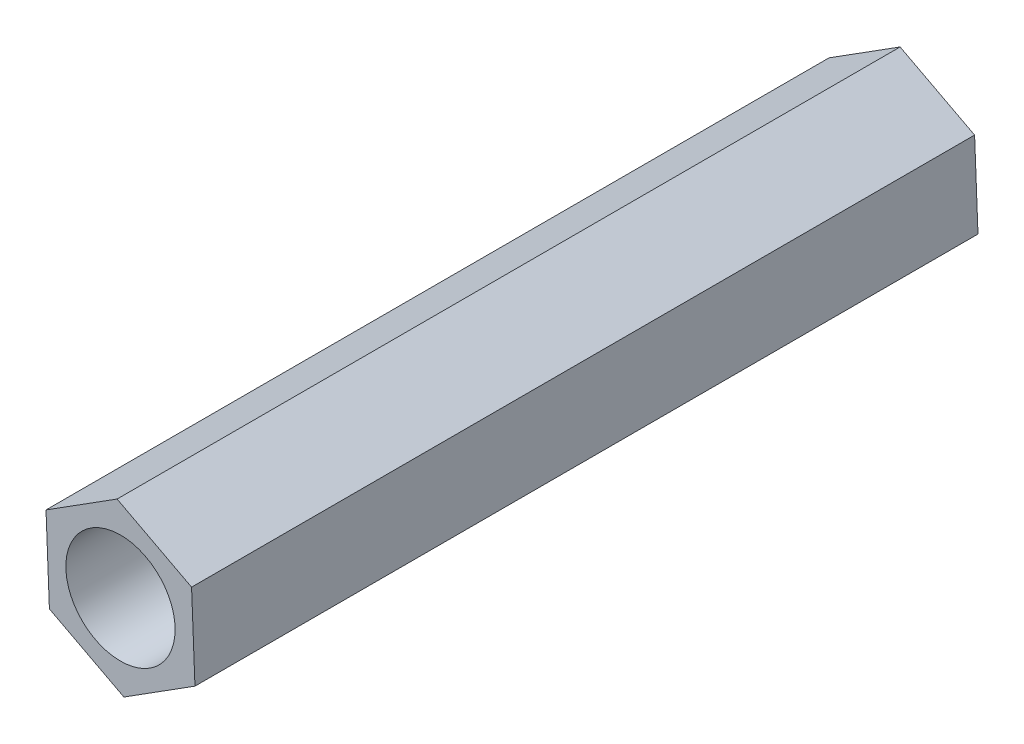
ISO-10303-21;
HEADER;
FILE_DESCRIPTION(('STEP AP214'),'2;1');
FILE_NAME('part.step','',(''),(''),'','','');
FILE_SCHEMA(('AUTOMOTIVE_DESIGN { 1 0 10303 214 1 1 1 1 }'));
ENDSEC;
DATA;
#1=APPLICATION_CONTEXT('core data for automotive mechanical design processes');
#2=APPLICATION_PROTOCOL_DEFINITION('international standard','automotive_design',2000,#1);
#3=PRODUCT_CONTEXT('',#1,'mechanical');
#4=PRODUCT('Part','Part','',(#3));
#5=PRODUCT_RELATED_PRODUCT_CATEGORY('part','',(#4));
#6=PRODUCT_DEFINITION_FORMATION('','',#4);
#7=PRODUCT_DEFINITION_CONTEXT('part definition',#1,'design');
#8=PRODUCT_DEFINITION('design','',#6,#7);
#9=PRODUCT_DEFINITION_SHAPE('','',#8);
#10=(LENGTH_UNIT() NAMED_UNIT(*) SI_UNIT(.MILLI.,.METRE.));
#11=(NAMED_UNIT(*) PLANE_ANGLE_UNIT() SI_UNIT($,.RADIAN.));
#12=(NAMED_UNIT(*) SI_UNIT($,.STERADIAN.) SOLID_ANGLE_UNIT());
#13=UNCERTAINTY_MEASURE_WITH_UNIT(LENGTH_MEASURE(1.E-05),#10,'distance_accuracy_value','');
#14=(GEOMETRIC_REPRESENTATION_CONTEXT(3) GLOBAL_UNCERTAINTY_ASSIGNED_CONTEXT((#13)) GLOBAL_UNIT_ASSIGNED_CONTEXT((#10,
#11,#12)) REPRESENTATION_CONTEXT('',''));
#15=CARTESIAN_POINT('',(0.,0.,0.));
#16=DIRECTION('',(0.,0.,1.));
#17=DIRECTION('',(1.,0.,0.));
#18=AXIS2_PLACEMENT_3D('',#15,#16,#17);
#19=CARTESIAN_POINT('',(0.187134398577121,-4.61500964789918,-43.));
#20=DIRECTION('',(-0.534677148957081,0.845056416094884,0.));
#21=DIRECTION('',(-0.845056416094884,-0.534677148957081,0.));
#22=AXIS2_PLACEMENT_3D('',#19,#20,#21);
#23=PLANE('',#22);
#24=DIRECTION('',(0.845056416094884,0.534677148957081,0.));
#25=VECTOR('',#24,1.);
#26=CARTESIAN_POINT('',(0.187134398577121,-4.61500964789918,0.));
#27=LINE('',#26,#25);
#28=CARTESIAN_POINT('',(0.187134398577121,-4.61500964789918,0.));
#29=VERTEX_POINT('',#28);
#30=CARTESIAN_POINT('',(4.09028279307952,-2.14544168085984,0.));
#31=VERTEX_POINT('',#30);
#32=EDGE_CURVE('E116',#29,#31,#27,.T.);
#33=ORIENTED_EDGE('',*,*,#32,.F.);
#34=DIRECTION('',(0.,0.,0.999999999999999));
#35=VECTOR('',#34,1.);
#36=CARTESIAN_POINT('',(0.187134398577121,-4.61500964789918,-43.));
#37=LINE('',#36,#35);
#38=CARTESIAN_POINT('',(0.187134398577121,-4.61500964789918,-43.));
#39=VERTEX_POINT('',#38);
#40=EDGE_CURVE('E115',#39,#29,#37,.T.);
#41=ORIENTED_EDGE('',*,*,#40,.F.);
#42=DIRECTION('',(0.845056416094884,0.534677148957081,0.));
#43=VECTOR('',#42,1.);
#44=CARTESIAN_POINT('',(0.187134398577121,-4.61500964789918,-43.));
#45=LINE('',#44,#43);
#46=CARTESIAN_POINT('',(4.09028279307952,-2.14544168085984,-43.));
#47=VERTEX_POINT('',#46);
#48=EDGE_CURVE('E129',#39,#47,#45,.T.);
#49=ORIENTED_EDGE('',*,*,#48,.T.);
#50=DIRECTION('',(0.,0.,0.999999999999999));
#51=VECTOR('',#50,1.);
#52=CARTESIAN_POINT('',(4.09028279307952,-2.14544168085984,-43.));
#53=LINE('',#52,#51);
#54=EDGE_CURVE('E11',#47,#31,#53,.T.);
#55=ORIENTED_EDGE('',*,*,#54,.T.);
#56=EDGE_LOOP('',(#33,#41,#49,#55));
#57=FACE_BOUND('',#56,.T.);
#58=ADVANCED_FACE('F33',(#57),#23,.F.);
#59=CARTESIAN_POINT('',(4.09028279307952,-2.14544168085984,-43.));
#60=DIRECTION('',(-0.999178898447743,-0.0405157857724263,0.));
#61=DIRECTION('',(0.0405157857724263,-0.999178898447743,0.));
#62=AXIS2_PLACEMENT_3D('',#59,#60,#61);
#63=PLANE('',#62);
#64=DIRECTION('',(-0.0405157857724263,0.999178898447742,0.));
#65=VECTOR('',#64,1.);
#66=CARTESIAN_POINT('',(4.09028279307952,-2.14544168085984,0.));
#67=LINE('',#66,#65);
#68=CARTESIAN_POINT('',(3.9031483945024,2.46956796703932,0.));
#69=VERTEX_POINT('',#68);
#70=EDGE_CURVE('E118',#31,#69,#67,.T.);
#71=ORIENTED_EDGE('',*,*,#70,.F.);
#72=ORIENTED_EDGE('',*,*,#54,.F.);
#73=DIRECTION('',(-0.0405157857724263,0.999178898447742,0.));
#74=VECTOR('',#73,1.);
#75=CARTESIAN_POINT('',(4.09028279307952,-2.14544168085984,-43.));
#76=LINE('',#75,#74);
#77=CARTESIAN_POINT('',(3.9031483945024,2.46956796703932,-43.));
#78=VERTEX_POINT('',#77);
#79=EDGE_CURVE('E81',#47,#78,#76,.T.);
#80=ORIENTED_EDGE('',*,*,#79,.T.);
#81=DIRECTION('',(0.,0.,0.999999999999999));
#82=VECTOR('',#81,1.);
#83=CARTESIAN_POINT('',(3.9031483945024,2.46956796703932,-43.));
#84=LINE('',#83,#82);
#85=EDGE_CURVE('E41',#78,#69,#84,.T.);
#86=ORIENTED_EDGE('',*,*,#85,.T.);
#87=EDGE_LOOP('',(#71,#72,#80,#86));
#88=FACE_BOUND('',#87,.T.);
#89=ADVANCED_FACE('F135',(#88),#63,.F.);
#90=CARTESIAN_POINT('',(3.9031483945024,2.46956796703932,-43.));
#91=DIRECTION('',(-0.464501749490663,-0.88557220186731,0.));
#92=DIRECTION('',(0.88557220186731,-0.464501749490663,0.));
#93=AXIS2_PLACEMENT_3D('',#90,#91,#92);
#94=PLANE('',#93);
#95=DIRECTION('',(-0.885572201867309,0.464501749490663,0.));
#96=VECTOR('',#95,1.);
#97=CARTESIAN_POINT('',(3.9031483945024,2.46956796703932,0.));
#98=LINE('',#97,#96);
#99=CARTESIAN_POINT('',(-0.187134398577107,4.61500964789924,0.));
#100=VERTEX_POINT('',#99);
#101=EDGE_CURVE('E122',#69,#100,#98,.T.);
#102=ORIENTED_EDGE('',*,*,#101,.F.);
#103=ORIENTED_EDGE('',*,*,#85,.F.);
#104=DIRECTION('',(-0.885572201867309,0.464501749490663,0.));
#105=VECTOR('',#104,1.);
#106=CARTESIAN_POINT('',(3.9031483945024,2.46956796703932,-43.));
#107=LINE('',#106,#105);
#108=CARTESIAN_POINT('',(-0.187134398577107,4.61500964789924,-43.));
#109=VERTEX_POINT('',#108);
#110=EDGE_CURVE('E109',#78,#109,#107,.T.);
#111=ORIENTED_EDGE('',*,*,#110,.T.);
#112=DIRECTION('',(0.,0.,0.999999999999999));
#113=VECTOR('',#112,1.);
#114=CARTESIAN_POINT('',(-0.187134398577107,4.61500964789924,-43.));
#115=LINE('',#114,#113);
#116=EDGE_CURVE('E103',#109,#100,#115,.T.);
#117=ORIENTED_EDGE('',*,*,#116,.T.);
#118=EDGE_LOOP('',(#102,#103,#111,#117));
#119=FACE_BOUND('',#118,.T.);
#120=ADVANCED_FACE('F169',(#119),#94,.F.);
#121=CARTESIAN_POINT('',(-0.187134398577107,4.61500964789924,-43.));
#122=DIRECTION('',(0.534677148957081,-0.845056416094884,0.));
#123=DIRECTION('',(0.845056416094884,0.534677148957081,0.));
#124=AXIS2_PLACEMENT_3D('',#121,#122,#123);
#125=PLANE('',#124);
#126=DIRECTION('',(-0.845056416094884,-0.534677148957081,0.));
#127=VECTOR('',#126,1.);
#128=CARTESIAN_POINT('',(-0.187134398577107,4.61500964789924,0.));
#129=LINE('',#128,#127);
#130=CARTESIAN_POINT('',(-4.0902827930796,2.14544168085995,0.));
#131=VERTEX_POINT('',#130);
#132=EDGE_CURVE('E125',#100,#131,#129,.T.);
#133=ORIENTED_EDGE('',*,*,#132,.F.);
#134=ORIENTED_EDGE('',*,*,#116,.F.);
#135=DIRECTION('',(-0.845056416094884,-0.534677148957081,0.));
#136=VECTOR('',#135,1.);
#137=CARTESIAN_POINT('',(-0.187134398577107,4.61500964789924,-43.));
#138=LINE('',#137,#136);
#139=CARTESIAN_POINT('',(-4.0902827930796,2.14544168085995,-43.));
#140=VERTEX_POINT('',#139);
#141=EDGE_CURVE('E93',#109,#140,#138,.T.);
#142=ORIENTED_EDGE('',*,*,#141,.T.);
#143=DIRECTION('',(0.,0.,0.999999999999999));
#144=VECTOR('',#143,1.);
#145=CARTESIAN_POINT('',(-4.0902827930796,2.14544168085995,-43.));
#146=LINE('',#145,#144);
#147=EDGE_CURVE('E98',#140,#131,#146,.T.);
#148=ORIENTED_EDGE('',*,*,#147,.T.);
#149=EDGE_LOOP('',(#133,#134,#142,#148));
#150=FACE_BOUND('',#149,.T.);
#151=ADVANCED_FACE('F106',(#150),#125,.F.);
#152=CARTESIAN_POINT('',(-4.0902827930796,2.14544168085995,-43.));
#153=DIRECTION('',(0.999178898447743,0.0405157857724258,0.));
#154=DIRECTION('',(-0.0405157857724258,0.999178898447743,0.));
#155=AXIS2_PLACEMENT_3D('',#152,#153,#154);
#156=PLANE('',#155);
#157=DIRECTION('',(0.0405157857724259,-0.999178898447742,0.));
#158=VECTOR('',#157,1.);
#159=CARTESIAN_POINT('',(-4.0902827930796,2.14544168085995,0.));
#160=LINE('',#159,#158);
#161=CARTESIAN_POINT('',(-3.90314839450248,-2.46956796703929,0.));
#162=VERTEX_POINT('',#161);
#163=EDGE_CURVE('E100',#131,#162,#160,.T.);
#164=ORIENTED_EDGE('',*,*,#163,.F.);
#165=ORIENTED_EDGE('',*,*,#147,.F.);
#166=DIRECTION('',(0.0405157857724259,-0.999178898447742,0.));
#167=VECTOR('',#166,1.);
#168=CARTESIAN_POINT('',(-4.0902827930796,2.14544168085995,-43.));
#169=LINE('',#168,#167);
#170=CARTESIAN_POINT('',(-3.90314839450248,-2.46956796703929,-43.));
#171=VERTEX_POINT('',#170);
#172=EDGE_CURVE('E89',#140,#171,#169,.T.);
#173=ORIENTED_EDGE('',*,*,#172,.T.);
#174=DIRECTION('',(0.,0.,0.999999999999999));
#175=VECTOR('',#174,1.);
#176=CARTESIAN_POINT('',(-3.90314839450248,-2.46956796703929,-43.));
#177=LINE('',#176,#175);
#178=EDGE_CURVE('E104',#171,#162,#177,.T.);
#179=ORIENTED_EDGE('',*,*,#178,.T.);
#180=EDGE_LOOP('',(#164,#165,#173,#179));
#181=FACE_BOUND('',#180,.T.);
#182=ADVANCED_FACE('F99',(#181),#156,.F.);
#183=CARTESIAN_POINT('',(-3.90314839450248,-2.46956796703929,-43.));
#184=DIRECTION('',(0.464501749490663,0.88557220186731,0.));
#185=DIRECTION('',(-0.88557220186731,0.464501749490663,0.));
#186=AXIS2_PLACEMENT_3D('',#183,#184,#185);
#187=PLANE('',#186);
#188=DIRECTION('',(0.88557220186731,-0.464501749490663,0.));
#189=VECTOR('',#188,1.);
#190=CARTESIAN_POINT('',(-3.90314839450248,-2.46956796703929,0.));
#191=LINE('',#190,#189);
#192=EDGE_CURVE('E69',#162,#29,#191,.T.);
#193=ORIENTED_EDGE('',*,*,#192,.F.);
#194=ORIENTED_EDGE('',*,*,#178,.F.);
#195=DIRECTION('',(0.88557220186731,-0.464501749490663,0.));
#196=VECTOR('',#195,1.);
#197=CARTESIAN_POINT('',(-3.90314839450248,-2.46956796703929,-43.));
#198=LINE('',#197,#196);
#199=EDGE_CURVE('E49',#171,#39,#198,.T.);
#200=ORIENTED_EDGE('',*,*,#199,.T.);
#201=ORIENTED_EDGE('',*,*,#40,.T.);
#202=EDGE_LOOP('',(#193,#194,#200,#201));
#203=FACE_BOUND('',#202,.T.);
#204=ADVANCED_FACE('F162',(#203),#187,.F.);
#205=CARTESIAN_POINT('',(0.,0.,-43.));
#206=DIRECTION('',(0.,0.,-0.999999999999999));
#207=DIRECTION('',(1.,0.,0.));
#208=AXIS2_PLACEMENT_3D('',#205,#206,#207);
#209=PLANE('',#208);
#210=CARTESIAN_POINT('',(0.,0.,-43.));
#211=DIRECTION('',(0.,0.,0.999999999999999));
#212=DIRECTION('',(1.,0.,0.));
#213=AXIS2_PLACEMENT_3D('',#210,#211,#212);
#214=CIRCLE('',#213,3.);
#215=CARTESIAN_POINT('',(3.,0.,-43.));
#216=VERTEX_POINT('',#215);
#217=EDGE_CURVE('E146',#216,#216,#214,.T.);
#218=ORIENTED_EDGE('',*,*,#217,.T.);
#219=EDGE_LOOP('',(#218));
#220=FACE_BOUND('',#219,.T.);
#221=ORIENTED_EDGE('',*,*,#48,.F.);
#222=ORIENTED_EDGE('',*,*,#199,.F.);
#223=ORIENTED_EDGE('',*,*,#172,.F.);
#224=ORIENTED_EDGE('',*,*,#141,.F.);
#225=ORIENTED_EDGE('',*,*,#110,.F.);
#226=ORIENTED_EDGE('',*,*,#79,.F.);
#227=EDGE_LOOP('',(#221,#222,#223,#224,#225,#226));
#228=FACE_BOUND('',#227,.T.);
#229=ADVANCED_FACE('F91',(#220,#228),#209,.T.);
#230=CARTESIAN_POINT('',(0.,0.,0.));
#231=DIRECTION('',(0.,0.,-0.999999999999999));
#232=DIRECTION('',(1.,0.,0.));
#233=AXIS2_PLACEMENT_3D('',#230,#231,#232);
#234=PLANE('',#233);
#235=CARTESIAN_POINT('',(0.,0.,0.));
#236=DIRECTION('',(0.,0.,0.999999999999999));
#237=DIRECTION('',(1.,0.,0.));
#238=AXIS2_PLACEMENT_3D('',#235,#236,#237);
#239=CIRCLE('',#238,3.);
#240=CARTESIAN_POINT('',(3.,0.,0.));
#241=VERTEX_POINT('',#240);
#242=EDGE_CURVE('E119',#241,#241,#239,.F.);
#243=ORIENTED_EDGE('',*,*,#242,.T.);
#244=EDGE_LOOP('',(#243));
#245=FACE_BOUND('',#244,.T.);
#246=ORIENTED_EDGE('',*,*,#32,.T.);
#247=ORIENTED_EDGE('',*,*,#70,.T.);
#248=ORIENTED_EDGE('',*,*,#101,.T.);
#249=ORIENTED_EDGE('',*,*,#132,.T.);
#250=ORIENTED_EDGE('',*,*,#163,.T.);
#251=ORIENTED_EDGE('',*,*,#192,.T.);
#252=EDGE_LOOP('',(#246,#247,#248,#249,#250,#251));
#253=FACE_BOUND('',#252,.T.);
#254=ADVANCED_FACE('F137',(#245,#253),#234,.F.);
#255=CARTESIAN_POINT('',(0.,0.,0.000999999999973245));
#256=DIRECTION('',(0.,0.,-0.999999999999999));
#257=DIRECTION('',(1.,0.,0.));
#258=AXIS2_PLACEMENT_3D('',#255,#256,#257);
#259=CYLINDRICAL_SURFACE('',#258,3.);
#260=CARTESIAN_POINT('',(3.,0.,-43.));
#261=CARTESIAN_POINT('',(3.,0.,-42.5520833333333));
#262=CARTESIAN_POINT('',(3.,0.,-42.1041666666666));
#263=CARTESIAN_POINT('',(3.,0.,-41.2083333333333));
#264=CARTESIAN_POINT('',(3.,0.,-40.7604166666666));
#265=CARTESIAN_POINT('',(3.,0.,-39.8645833333333));
#266=CARTESIAN_POINT('',(3.,0.,-39.4166666666667));
#267=CARTESIAN_POINT('',(3.,0.,-38.5208333333333));
#268=CARTESIAN_POINT('',(3.,0.,-38.0729166666667));
#269=CARTESIAN_POINT('',(3.,0.,-37.1770833333333));
#270=CARTESIAN_POINT('',(3.,0.,-36.7291666666666));
#271=CARTESIAN_POINT('',(3.,0.,-35.8333333333333));
#272=CARTESIAN_POINT('',(3.,0.,-35.3854166666667));
#273=CARTESIAN_POINT('',(3.,0.,-34.4895833333333));
#274=CARTESIAN_POINT('',(3.,0.,-34.0416666666667));
#275=CARTESIAN_POINT('',(3.,0.,-33.1458333333333));
#276=CARTESIAN_POINT('',(3.,0.,-32.6979166666667));
#277=CARTESIAN_POINT('',(3.,0.,-31.8020833333333));
#278=CARTESIAN_POINT('',(3.,0.,-31.3541666666667));
#279=CARTESIAN_POINT('',(3.,0.,-30.4583333333333));
#280=CARTESIAN_POINT('',(3.,0.,-30.0104166666667));
#281=CARTESIAN_POINT('',(3.,0.,-29.1145833333333));
#282=CARTESIAN_POINT('',(3.,0.,-28.6666666666667));
#283=CARTESIAN_POINT('',(3.,0.,-27.7708333333333));
#284=CARTESIAN_POINT('',(3.,0.,-27.3229166666667));
#285=CARTESIAN_POINT('',(3.,0.,-26.4270833333333));
#286=CARTESIAN_POINT('',(3.,0.,-25.9791666666667));
#287=CARTESIAN_POINT('',(3.,0.,-25.0833333333333));
#288=CARTESIAN_POINT('',(3.,0.,-24.6354166666667));
#289=CARTESIAN_POINT('',(3.,0.,-23.7395833333333));
#290=CARTESIAN_POINT('',(3.,0.,-23.2916666666667));
#291=CARTESIAN_POINT('',(3.,0.,-22.3958333333333));
#292=CARTESIAN_POINT('',(3.,0.,-21.9479166666667));
#293=CARTESIAN_POINT('',(3.,0.,-21.0520833333333));
#294=CARTESIAN_POINT('',(3.,0.,-20.6041666666667));
#295=CARTESIAN_POINT('',(3.,0.,-19.7083333333333));
#296=CARTESIAN_POINT('',(3.,0.,-19.2604166666667));
#297=CARTESIAN_POINT('',(3.,0.,-18.3645833333333));
#298=CARTESIAN_POINT('',(3.,0.,-17.9166666666667));
#299=CARTESIAN_POINT('',(3.,0.,-17.0208333333333));
#300=CARTESIAN_POINT('',(3.,0.,-16.5729166666667));
#301=CARTESIAN_POINT('',(3.,0.,-15.6770833333333));
#302=CARTESIAN_POINT('',(3.,0.,-15.2291666666667));
#303=CARTESIAN_POINT('',(3.,0.,-14.3333333333333));
#304=CARTESIAN_POINT('',(3.,0.,-13.8854166666667));
#305=CARTESIAN_POINT('',(3.,0.,-12.9895833333333));
#306=CARTESIAN_POINT('',(3.,0.,-12.5416666666667));
#307=CARTESIAN_POINT('',(3.,0.,-11.6458333333333));
#308=CARTESIAN_POINT('',(3.,0.,-11.1979166666667));
#309=CARTESIAN_POINT('',(3.,0.,-10.3020833333333));
#310=CARTESIAN_POINT('',(3.,0.,-9.85416666666666));
#311=CARTESIAN_POINT('',(3.,0.,-8.95833333333333));
#312=CARTESIAN_POINT('',(3.,0.,-8.51041666666666));
#313=CARTESIAN_POINT('',(3.,0.,-7.61458333333333));
#314=CARTESIAN_POINT('',(3.,0.,-7.16666666666667));
#315=CARTESIAN_POINT('',(3.,0.,-6.27083333333333));
#316=CARTESIAN_POINT('',(3.,0.,-5.82291666666667));
#317=CARTESIAN_POINT('',(3.,0.,-4.92708333333333));
#318=CARTESIAN_POINT('',(3.,0.,-4.47916666666666));
#319=CARTESIAN_POINT('',(3.,0.,-3.58333333333333));
#320=CARTESIAN_POINT('',(3.,0.,-3.13541666666666));
#321=CARTESIAN_POINT('',(3.,0.,-2.23958333333333));
#322=CARTESIAN_POINT('',(3.,0.,-1.79166666666667));
#323=CARTESIAN_POINT('',(3.,0.,-0.895833333333335));
#324=CARTESIAN_POINT('',(3.,0.,-0.447916666666668));
#325=CARTESIAN_POINT('',(3.,0.,0.));
#326=B_SPLINE_CURVE_WITH_KNOTS('',3,(#260,#261,#262,#263,#264,#265,#266,#267,#268,#269,#270,
#271,#272,#273,#274,#275,#276,#277,#278,#279,#280,#281,#282,#283,#284,#285,#286,#287,#288,#289,
#290,#291,#292,#293,#294,#295,#296,#297,#298,#299,#300,#301,#302,#303,#304,#305,#306,#307,#308,
#309,#310,#311,#312,#313,#314,#315,#316,#317,#318,#319,#320,#321,#322,#323,#324,#325),
.UNSPECIFIED.,.F.,.F.,(4,2,2,2,2,2,2,2,2,2,2,2,2,2,2,2,2,2,2,2,2,2,2,2,2,2,2,2,2,2,2,2,4),(0.,
1.34375,2.6875,4.03124999999999,5.375,6.71875,8.0625,9.40624999999999,10.75,12.09375,13.4375,
14.78125,16.125,17.46875,18.8125,20.15625,21.5,22.84375,24.1875,25.53125,26.875,28.21875,
29.5625,30.90625,32.25,33.59375,34.9375,36.28125,37.625,38.96875,40.3125,41.65625,43.),.UNSPECIFIED.);
#327=EDGE_CURVE('BSEAM151',#216,#241,#326,.T.);
#328=ORIENTED_EDGE('',*,*,#217,.F.);
#329=ORIENTED_EDGE('',*,*,#242,.F.);
#330=ORIENTED_EDGE('',*,*,#327,.T.);
#331=ORIENTED_EDGE('',*,*,#327,.F.);
#332=EDGE_LOOP('',(#328,#330,#329,#331));
#333=FACE_BOUND('',#332,.T.);
#334=ADVANCED_FACE('F151',(#333),#259,.F.);
#335=CLOSED_SHELL('',(#58,#89,#120,#151,#182,#204,#229,#254,#334));
#336=MANIFOLD_SOLID_BREP('B2',#335);
#337=ADVANCED_BREP_SHAPE_REPRESENTATION('',(#18,#336),#14);
#338=SHAPE_DEFINITION_REPRESENTATION(#9,#337);
ENDSEC;
END-ISO-10303-21;
